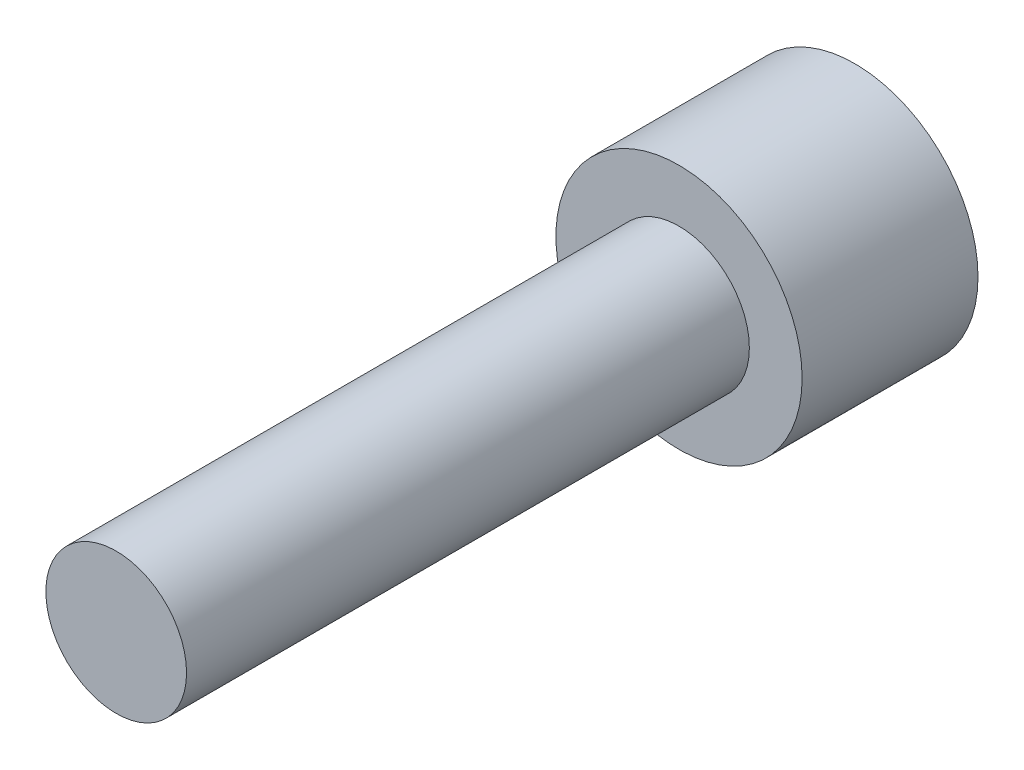
ISO-10303-21;
HEADER;
FILE_DESCRIPTION(('STEP AP214'),'2;1');
FILE_NAME('part.step','',(''),(''),'','','');
FILE_SCHEMA(('AUTOMOTIVE_DESIGN { 1 0 10303 214 1 1 1 1 }'));
ENDSEC;
DATA;
#1=APPLICATION_CONTEXT('core data for automotive mechanical design processes');
#2=APPLICATION_PROTOCOL_DEFINITION('international standard','automotive_design',2000,#1);
#3=PRODUCT_CONTEXT('',#1,'mechanical');
#4=PRODUCT('Part','Part','',(#3));
#5=PRODUCT_RELATED_PRODUCT_CATEGORY('part','',(#4));
#6=PRODUCT_DEFINITION_FORMATION('','',#4);
#7=PRODUCT_DEFINITION_CONTEXT('part definition',#1,'design');
#8=PRODUCT_DEFINITION('design','',#6,#7);
#9=PRODUCT_DEFINITION_SHAPE('','',#8);
#10=(LENGTH_UNIT() NAMED_UNIT(*) SI_UNIT(.MILLI.,.METRE.));
#11=(NAMED_UNIT(*) PLANE_ANGLE_UNIT() SI_UNIT($,.RADIAN.));
#12=(NAMED_UNIT(*) SI_UNIT($,.STERADIAN.) SOLID_ANGLE_UNIT());
#13=UNCERTAINTY_MEASURE_WITH_UNIT(LENGTH_MEASURE(1.E-05),#10,'distance_accuracy_value','');
#14=(GEOMETRIC_REPRESENTATION_CONTEXT(3) GLOBAL_UNCERTAINTY_ASSIGNED_CONTEXT((#13)) GLOBAL_UNIT_ASSIGNED_CONTEXT((#10,
#11,#12)) REPRESENTATION_CONTEXT('',''));
#15=CARTESIAN_POINT('',(0.,0.,0.));
#16=DIRECTION('',(0.,0.,1.));
#17=DIRECTION('',(1.,0.,0.));
#18=AXIS2_PLACEMENT_3D('',#15,#16,#17);
#19=CARTESIAN_POINT('',(0.,0.,2.5));
#20=DIRECTION('',(0.,0.,1.));
#21=DIRECTION('',(1.,0.,0.));
#22=AXIS2_PLACEMENT_3D('',#19,#20,#21);
#23=PLANE('',#22);
#24=CARTESIAN_POINT('',(0.,0.,2.5));
#25=DIRECTION('',(0.,0.,1.));
#26=DIRECTION('',(1.,0.,0.));
#27=AXIS2_PLACEMENT_3D('',#24,#25,#26);
#28=CIRCLE('',#27,1.75);
#29=CARTESIAN_POINT('',(1.75,0.,2.5));
#30=VERTEX_POINT('',#29);
#31=EDGE_CURVE('E11',#30,#30,#28,.T.);
#32=ORIENTED_EDGE('',*,*,#31,.T.);
#33=EDGE_LOOP('',(#32));
#34=FACE_BOUND('',#33,.T.);
#35=CARTESIAN_POINT('',(0.,0.,2.5));
#36=DIRECTION('',(0.,0.,1.));
#37=DIRECTION('',(1.,0.,0.));
#38=AXIS2_PLACEMENT_3D('',#35,#36,#37);
#39=CIRCLE('',#38,1.);
#40=CARTESIAN_POINT('',(1.,0.,2.5));
#41=VERTEX_POINT('',#40);
#42=EDGE_CURVE('E134',#41,#41,#39,.T.);
#43=ORIENTED_EDGE('',*,*,#42,.F.);
#44=EDGE_LOOP('',(#43));
#45=FACE_BOUND('',#44,.T.);
#46=ADVANCED_FACE('F32',(#34,#45),#23,.T.);
#47=CARTESIAN_POINT('',(0.,0.,2.5));
#48=DIRECTION('',(0.,0.,-1.));
#49=DIRECTION('',(-1.,0.,0.));
#50=AXIS2_PLACEMENT_3D('',#47,#48,#49);
#51=CYLINDRICAL_SURFACE('',#50,1.75);
#52=ORIENTED_EDGE('',*,*,#31,.F.);
#53=EDGE_LOOP('',(#52));
#54=FACE_BOUND('',#53,.T.);
#55=CARTESIAN_POINT('',(0.,0.,0.));
#56=DIRECTION('',(0.,0.,1.));
#57=DIRECTION('',(1.,0.,0.));
#58=AXIS2_PLACEMENT_3D('',#55,#56,#57);
#59=CIRCLE('',#58,1.75);
#60=CARTESIAN_POINT('',(1.75,0.,0.));
#61=VERTEX_POINT('',#60);
#62=EDGE_CURVE('E36',#61,#61,#59,.T.);
#63=ORIENTED_EDGE('',*,*,#62,.T.);
#64=EDGE_LOOP('',(#63));
#65=FACE_BOUND('',#64,.T.);
#66=ADVANCED_FACE('F34',(#54,#65),#51,.T.);
#67=CARTESIAN_POINT('',(0.,0.,0.));
#68=DIRECTION('',(0.,0.,1.));
#69=DIRECTION('',(1.,0.,0.));
#70=AXIS2_PLACEMENT_3D('',#67,#68,#69);
#71=PLANE('',#70);
#72=DIRECTION('',(0.5,0.866025403784438,0.));
#73=VECTOR('',#72,1.);
#74=CARTESIAN_POINT('',(-1.44337567297406,0.,0.));
#75=LINE('',#74,#73);
#76=CARTESIAN_POINT('',(-1.44337567297406,0.,0.));
#77=VERTEX_POINT('',#76);
#78=CARTESIAN_POINT('',(-0.721687836487032,1.25,0.));
#79=VERTEX_POINT('',#78);
#80=EDGE_CURVE('E121',#77,#79,#75,.T.);
#81=ORIENTED_EDGE('',*,*,#80,.F.);
#82=DIRECTION('',(-0.5,0.866025403784439,0.));
#83=VECTOR('',#82,1.);
#84=CARTESIAN_POINT('',(-0.721687836487033,-1.25,0.));
#85=LINE('',#84,#83);
#86=CARTESIAN_POINT('',(-0.721687836487033,-1.25,0.));
#87=VERTEX_POINT('',#86);
#88=EDGE_CURVE('E47',#87,#77,#85,.T.);
#89=ORIENTED_EDGE('',*,*,#88,.F.);
#90=DIRECTION('',(-1.,0.,0.));
#91=VECTOR('',#90,1.);
#92=CARTESIAN_POINT('',(0.721687836487032,-1.25,0.));
#93=LINE('',#92,#91);
#94=CARTESIAN_POINT('',(0.721687836487032,-1.25,0.));
#95=VERTEX_POINT('',#94);
#96=EDGE_CURVE('E130',#95,#87,#93,.T.);
#97=ORIENTED_EDGE('',*,*,#96,.F.);
#98=DIRECTION('',(-0.5,-0.866025403784439,0.));
#99=VECTOR('',#98,1.);
#100=CARTESIAN_POINT('',(1.44337567297406,0.,0.));
#101=LINE('',#100,#99);
#102=CARTESIAN_POINT('',(1.44337567297406,0.,0.));
#103=VERTEX_POINT('',#102);
#104=EDGE_CURVE('E128',#103,#95,#101,.T.);
#105=ORIENTED_EDGE('',*,*,#104,.F.);
#106=DIRECTION('',(0.5,-0.866025403784439,0.));
#107=VECTOR('',#106,1.);
#108=CARTESIAN_POINT('',(0.721687836487033,1.25,0.));
#109=LINE('',#108,#107);
#110=CARTESIAN_POINT('',(0.721687836487033,1.25,0.));
#111=VERTEX_POINT('',#110);
#112=EDGE_CURVE('E95',#111,#103,#109,.T.);
#113=ORIENTED_EDGE('',*,*,#112,.F.);
#114=DIRECTION('',(1.,0.,0.));
#115=VECTOR('',#114,1.);
#116=CARTESIAN_POINT('',(-0.721687836487032,1.25,0.));
#117=LINE('',#116,#115);
#118=EDGE_CURVE('E124',#79,#111,#117,.T.);
#119=ORIENTED_EDGE('',*,*,#118,.F.);
#120=EDGE_LOOP('',(#81,#89,#97,#105,#113,#119));
#121=FACE_BOUND('',#120,.T.);
#122=ORIENTED_EDGE('',*,*,#62,.F.);
#123=EDGE_LOOP('',(#122));
#124=FACE_BOUND('',#123,.T.);
#125=ADVANCED_FACE('F154',(#121,#124),#71,.F.);
#126=CARTESIAN_POINT('',(0.,0.,10.5));
#127=DIRECTION('',(0.,0.,-1.));
#128=DIRECTION('',(-1.,0.,0.));
#129=AXIS2_PLACEMENT_3D('',#126,#127,#128);
#130=CYLINDRICAL_SURFACE('',#129,1.);
#131=CARTESIAN_POINT('',(0.,0.,10.5));
#132=DIRECTION('',(0.,0.,1.));
#133=DIRECTION('',(1.,0.,0.));
#134=AXIS2_PLACEMENT_3D('',#131,#132,#133);
#135=CIRCLE('',#134,1.);
#136=CARTESIAN_POINT('',(1.,0.,10.5));
#137=VERTEX_POINT('',#136);
#138=EDGE_CURVE('E140',#137,#137,#135,.T.);
#139=ORIENTED_EDGE('',*,*,#138,.F.);
#140=EDGE_LOOP('',(#139));
#141=FACE_BOUND('',#140,.T.);
#142=ORIENTED_EDGE('',*,*,#42,.T.);
#143=EDGE_LOOP('',(#142));
#144=FACE_BOUND('',#143,.T.);
#145=ADVANCED_FACE('F146',(#141,#144),#130,.T.);
#146=CARTESIAN_POINT('',(0.,0.,10.5));
#147=DIRECTION('',(0.,0.,1.));
#148=DIRECTION('',(1.,0.,0.));
#149=AXIS2_PLACEMENT_3D('',#146,#147,#148);
#150=PLANE('',#149);
#151=ORIENTED_EDGE('',*,*,#138,.T.);
#152=EDGE_LOOP('',(#151));
#153=FACE_BOUND('',#152,.T.);
#154=ADVANCED_FACE('F163',(#153),#150,.T.);
#155=CARTESIAN_POINT('',(-0.721687836487033,-1.25,1.75));
#156=DIRECTION('',(-0.866025403784439,-0.5,0.));
#157=DIRECTION('',(0.5,-0.866025403784439,0.));
#158=AXIS2_PLACEMENT_3D('',#155,#156,#157);
#159=PLANE('',#158);
#160=ORIENTED_EDGE('',*,*,#88,.T.);
#161=DIRECTION('',(0.,0.,-1.));
#162=VECTOR('',#161,1.);
#163=CARTESIAN_POINT('',(-1.44337567297406,0.,1.75));
#164=LINE('',#163,#162);
#165=CARTESIAN_POINT('',(-1.44337567297406,0.,1.75));
#166=VERTEX_POINT('',#165);
#167=EDGE_CURVE('E77',#166,#77,#164,.T.);
#168=ORIENTED_EDGE('',*,*,#167,.F.);
#169=DIRECTION('',(-0.5,0.866025403784439,0.));
#170=VECTOR('',#169,1.);
#171=CARTESIAN_POINT('',(-0.721687836487033,-1.25,1.75));
#172=LINE('',#171,#170);
#173=CARTESIAN_POINT('',(-0.721687836487033,-1.25,1.75));
#174=VERTEX_POINT('',#173);
#175=EDGE_CURVE('E132',#174,#166,#172,.T.);
#176=ORIENTED_EDGE('',*,*,#175,.F.);
#177=DIRECTION('',(0.,0.,-1.));
#178=VECTOR('',#177,1.);
#179=CARTESIAN_POINT('',(-0.721687836487033,-1.25,1.75));
#180=LINE('',#179,#178);
#181=EDGE_CURVE('E55',#174,#87,#180,.T.);
#182=ORIENTED_EDGE('',*,*,#181,.T.);
#183=EDGE_LOOP('',(#160,#168,#176,#182));
#184=FACE_BOUND('',#183,.T.);
#185=ADVANCED_FACE('F175',(#184),#159,.F.);
#186=CARTESIAN_POINT('',(0.721687836487032,-1.25,1.75));
#187=DIRECTION('',(0.,-1.,0.));
#188=DIRECTION('',(1.,0.,0.));
#189=AXIS2_PLACEMENT_3D('',#186,#187,#188);
#190=PLANE('',#189);
#191=ORIENTED_EDGE('',*,*,#96,.T.);
#192=ORIENTED_EDGE('',*,*,#181,.F.);
#193=DIRECTION('',(-1.,0.,0.));
#194=VECTOR('',#193,1.);
#195=CARTESIAN_POINT('',(0.721687836487032,-1.25,1.75));
#196=LINE('',#195,#194);
#197=CARTESIAN_POINT('',(0.721687836487032,-1.25,1.75));
#198=VERTEX_POINT('',#197);
#199=EDGE_CURVE('E107',#198,#174,#196,.T.);
#200=ORIENTED_EDGE('',*,*,#199,.F.);
#201=DIRECTION('',(0.,0.,-1.));
#202=VECTOR('',#201,1.);
#203=CARTESIAN_POINT('',(0.721687836487032,-1.25,1.75));
#204=LINE('',#203,#202);
#205=EDGE_CURVE('E99',#198,#95,#204,.T.);
#206=ORIENTED_EDGE('',*,*,#205,.T.);
#207=EDGE_LOOP('',(#191,#192,#200,#206));
#208=FACE_BOUND('',#207,.T.);
#209=ADVANCED_FACE('F177',(#208),#190,.F.);
#210=CARTESIAN_POINT('',(1.44337567297406,0.,1.75));
#211=DIRECTION('',(0.866025403784439,-0.5,0.));
#212=DIRECTION('',(0.5,0.866025403784439,0.));
#213=AXIS2_PLACEMENT_3D('',#210,#211,#212);
#214=PLANE('',#213);
#215=ORIENTED_EDGE('',*,*,#104,.T.);
#216=ORIENTED_EDGE('',*,*,#205,.F.);
#217=DIRECTION('',(-0.5,-0.866025403784439,0.));
#218=VECTOR('',#217,1.);
#219=CARTESIAN_POINT('',(1.44337567297406,0.,1.75));
#220=LINE('',#219,#218);
#221=CARTESIAN_POINT('',(1.44337567297406,0.,1.75));
#222=VERTEX_POINT('',#221);
#223=EDGE_CURVE('E103',#222,#198,#220,.T.);
#224=ORIENTED_EDGE('',*,*,#223,.F.);
#225=DIRECTION('',(0.,0.,-1.));
#226=VECTOR('',#225,1.);
#227=CARTESIAN_POINT('',(1.44337567297406,0.,1.75));
#228=LINE('',#227,#226);
#229=EDGE_CURVE('E88',#222,#103,#228,.T.);
#230=ORIENTED_EDGE('',*,*,#229,.T.);
#231=EDGE_LOOP('',(#215,#216,#224,#230));
#232=FACE_BOUND('',#231,.T.);
#233=ADVANCED_FACE('F104',(#232),#214,.F.);
#234=CARTESIAN_POINT('',(0.721687836487033,1.25,1.75));
#235=DIRECTION('',(0.866025403784439,0.5,0.));
#236=DIRECTION('',(-0.5,0.866025403784439,0.));
#237=AXIS2_PLACEMENT_3D('',#234,#235,#236);
#238=PLANE('',#237);
#239=ORIENTED_EDGE('',*,*,#112,.T.);
#240=ORIENTED_EDGE('',*,*,#229,.F.);
#241=DIRECTION('',(0.5,-0.866025403784439,0.));
#242=VECTOR('',#241,1.);
#243=CARTESIAN_POINT('',(0.721687836487033,1.25,1.75));
#244=LINE('',#243,#242);
#245=CARTESIAN_POINT('',(0.721687836487033,1.25,1.75));
#246=VERTEX_POINT('',#245);
#247=EDGE_CURVE('E92',#246,#222,#244,.T.);
#248=ORIENTED_EDGE('',*,*,#247,.F.);
#249=DIRECTION('',(0.,0.,-1.));
#250=VECTOR('',#249,1.);
#251=CARTESIAN_POINT('',(0.721687836487033,1.25,1.75));
#252=LINE('',#251,#250);
#253=EDGE_CURVE('E100',#246,#111,#252,.T.);
#254=ORIENTED_EDGE('',*,*,#253,.T.);
#255=EDGE_LOOP('',(#239,#240,#248,#254));
#256=FACE_BOUND('',#255,.T.);
#257=ADVANCED_FACE('F90',(#256),#238,.F.);
#258=CARTESIAN_POINT('',(-0.721687836487032,1.25,1.75));
#259=DIRECTION('',(0.,1.,0.));
#260=DIRECTION('',(0.,0.,1.));
#261=AXIS2_PLACEMENT_3D('',#258,#259,#260);
#262=PLANE('',#261);
#263=ORIENTED_EDGE('',*,*,#118,.T.);
#264=ORIENTED_EDGE('',*,*,#253,.F.);
#265=DIRECTION('',(1.,0.,0.));
#266=VECTOR('',#265,1.);
#267=CARTESIAN_POINT('',(-0.721687836487032,1.25,1.75));
#268=LINE('',#267,#266);
#269=CARTESIAN_POINT('',(-0.721687836487032,1.25,1.75));
#270=VERTEX_POINT('',#269);
#271=EDGE_CURVE('E113',#270,#246,#268,.T.);
#272=ORIENTED_EDGE('',*,*,#271,.F.);
#273=DIRECTION('',(0.,0.,-1.));
#274=VECTOR('',#273,1.);
#275=CARTESIAN_POINT('',(-0.721687836487032,1.25,1.75));
#276=LINE('',#275,#274);
#277=EDGE_CURVE('E137',#270,#79,#276,.T.);
#278=ORIENTED_EDGE('',*,*,#277,.T.);
#279=EDGE_LOOP('',(#263,#264,#272,#278));
#280=FACE_BOUND('',#279,.T.);
#281=ADVANCED_FACE('F188',(#280),#262,.F.);
#282=CARTESIAN_POINT('',(-1.44337567297406,0.,1.75));
#283=DIRECTION('',(-0.866025403784438,0.5,0.));
#284=DIRECTION('',(-0.5,-0.866025403784439,0.));
#285=AXIS2_PLACEMENT_3D('',#282,#283,#284);
#286=PLANE('',#285);
#287=ORIENTED_EDGE('',*,*,#80,.T.);
#288=ORIENTED_EDGE('',*,*,#277,.F.);
#289=DIRECTION('',(0.5,0.866025403784438,0.));
#290=VECTOR('',#289,1.);
#291=CARTESIAN_POINT('',(-1.44337567297406,0.,1.75));
#292=LINE('',#291,#290);
#293=EDGE_CURVE('E115',#166,#270,#292,.T.);
#294=ORIENTED_EDGE('',*,*,#293,.F.);
#295=ORIENTED_EDGE('',*,*,#167,.T.);
#296=EDGE_LOOP('',(#287,#288,#294,#295));
#297=FACE_BOUND('',#296,.T.);
#298=ADVANCED_FACE('F173',(#297),#286,.F.);
#299=CARTESIAN_POINT('',(0.,0.,1.75));
#300=DIRECTION('',(0.,0.,-1.));
#301=DIRECTION('',(-1.,0.,0.));
#302=AXIS2_PLACEMENT_3D('',#299,#300,#301);
#303=PLANE('',#302);
#304=ORIENTED_EDGE('',*,*,#175,.T.);
#305=ORIENTED_EDGE('',*,*,#293,.T.);
#306=ORIENTED_EDGE('',*,*,#271,.T.);
#307=ORIENTED_EDGE('',*,*,#247,.T.);
#308=ORIENTED_EDGE('',*,*,#223,.T.);
#309=ORIENTED_EDGE('',*,*,#199,.T.);
#310=EDGE_LOOP('',(#304,#305,#306,#307,#308,#309));
#311=FACE_BOUND('',#310,.T.);
#312=ADVANCED_FACE('F110',(#311),#303,.T.);
#313=CLOSED_SHELL('',(#46,#66,#125,#145,#154,#185,#209,#233,#257,#281,#298,#312));
#314=MANIFOLD_SOLID_BREP('B2',#313);
#315=ADVANCED_BREP_SHAPE_REPRESENTATION('',(#18,#314),#14);
#316=SHAPE_DEFINITION_REPRESENTATION(#9,#315);
ENDSEC;
END-ISO-10303-21;
